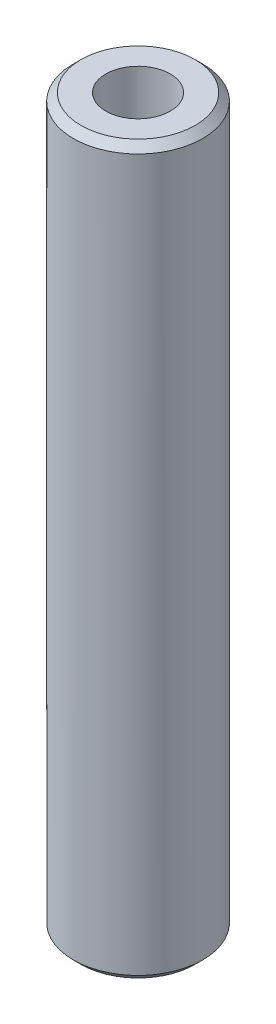
ISO-10303-21;
HEADER;
FILE_DESCRIPTION(('STEP AP214'),'2;1');
FILE_NAME('part.step','',(''),(''),'','','');
FILE_SCHEMA(('AUTOMOTIVE_DESIGN { 1 0 10303 214 1 1 1 1 }'));
ENDSEC;
DATA;
#1=APPLICATION_CONTEXT('core data for automotive mechanical design processes');
#2=APPLICATION_PROTOCOL_DEFINITION('international standard','automotive_design',2000,#1);
#3=PRODUCT_CONTEXT('',#1,'mechanical');
#4=PRODUCT('Part','Part','',(#3));
#5=PRODUCT_RELATED_PRODUCT_CATEGORY('part','',(#4));
#6=PRODUCT_DEFINITION_FORMATION('','',#4);
#7=PRODUCT_DEFINITION_CONTEXT('part definition',#1,'design');
#8=PRODUCT_DEFINITION('design','',#6,#7);
#9=PRODUCT_DEFINITION_SHAPE('','',#8);
#10=(LENGTH_UNIT() NAMED_UNIT(*) SI_UNIT(.MILLI.,.METRE.));
#11=(NAMED_UNIT(*) PLANE_ANGLE_UNIT() SI_UNIT($,.RADIAN.));
#12=(NAMED_UNIT(*) SI_UNIT($,.STERADIAN.) SOLID_ANGLE_UNIT());
#13=UNCERTAINTY_MEASURE_WITH_UNIT(LENGTH_MEASURE(1.E-05),#10,'distance_accuracy_value','');
#14=(GEOMETRIC_REPRESENTATION_CONTEXT(3) GLOBAL_UNCERTAINTY_ASSIGNED_CONTEXT((#13)) GLOBAL_UNIT_ASSIGNED_CONTEXT((#10,
#11,#12)) REPRESENTATION_CONTEXT('',''));
#15=CARTESIAN_POINT('',(0.,0.,0.));
#16=DIRECTION('',(0.,0.,1.));
#17=DIRECTION('',(1.,0.,0.));
#18=AXIS2_PLACEMENT_3D('',#15,#16,#17);
#19=CARTESIAN_POINT('',(0.,365.264584804226,0.));
#20=DIRECTION('',(0.,-1.,0.));
#21=DIRECTION('',(0.,0.,-1.));
#22=AXIS2_PLACEMENT_3D('',#19,#20,#21);
#23=CYLINDRICAL_SURFACE('',#22,32.5);
#24=CARTESIAN_POINT('',(0.,361.465812098298,0.));
#25=DIRECTION('',(0.,1.,0.));
#26=DIRECTION('',(0.,0.,1.));
#27=AXIS2_PLACEMENT_3D('',#24,#25,#26);
#28=CIRCLE('',#27,32.5);
#29=CARTESIAN_POINT('',(0.,361.465812098298,-32.5));
#30=VERTEX_POINT('',#29);
#31=EDGE_CURVE('E50',#30,#30,#28,.F.);
#32=CARTESIAN_POINT('',(0.,3.79877270592843,0.));
#33=DIRECTION('',(0.,1.,0.));
#34=DIRECTION('',(0.,0.,1.));
#35=AXIS2_PLACEMENT_3D('',#32,#33,#34);
#36=CIRCLE('',#35,32.5);
#37=CARTESIAN_POINT('',(0.,3.79877270592843,-32.5));
#38=VERTEX_POINT('',#37);
#39=EDGE_CURVE('E51',#38,#38,#36,.T.);
#40=CARTESIAN_POINT('',(0.,361.465812098298,-32.5));
#41=CARTESIAN_POINT('',(0.,357.740113771294,-32.5));
#42=CARTESIAN_POINT('',(0.,354.014415444291,-32.5));
#43=CARTESIAN_POINT('',(0.,346.563018790283,-32.5));
#44=CARTESIAN_POINT('',(0.,342.837320463279,-32.5));
#45=CARTESIAN_POINT('',(0.,335.385923809271,-32.5));
#46=CARTESIAN_POINT('',(0.,331.660225482267,-32.5));
#47=CARTESIAN_POINT('',(0.,324.20882882826,-32.5));
#48=CARTESIAN_POINT('',(0.,320.483130501256,-32.5));
#49=CARTESIAN_POINT('',(0.,313.031733847248,-32.5));
#50=CARTESIAN_POINT('',(0.,309.306035520244,-32.5));
#51=CARTESIAN_POINT('',(0.,301.854638866237,-32.5));
#52=CARTESIAN_POINT('',(0.,298.128940539233,-32.5));
#53=CARTESIAN_POINT('',(0.,290.677543885225,-32.5));
#54=CARTESIAN_POINT('',(0.,286.951845558221,-32.5));
#55=CARTESIAN_POINT('',(0.,279.500448904213,-32.5));
#56=CARTESIAN_POINT('',(0.,275.77475057721,-32.5));
#57=CARTESIAN_POINT('',(0.,268.323353923202,-32.5));
#58=CARTESIAN_POINT('',(0.,264.597655596198,-32.5));
#59=CARTESIAN_POINT('',(0.,257.14625894219,-32.5));
#60=CARTESIAN_POINT('',(0.,253.420560615187,-32.5));
#61=CARTESIAN_POINT('',(0.,245.969163961179,-32.5));
#62=CARTESIAN_POINT('',(0.,242.243465634175,-32.5));
#63=CARTESIAN_POINT('',(0.,234.792068980167,-32.5));
#64=CARTESIAN_POINT('',(0.,231.066370653163,-32.5));
#65=CARTESIAN_POINT('',(0.,223.614973999156,-32.5));
#66=CARTESIAN_POINT('',(0.,219.889275672152,-32.5));
#67=CARTESIAN_POINT('',(0.,212.437879018144,-32.5));
#68=CARTESIAN_POINT('',(0.,208.71218069114,-32.5));
#69=CARTESIAN_POINT('',(0.,201.260784037133,-32.5));
#70=CARTESIAN_POINT('',(0.,197.535085710129,-32.5));
#71=CARTESIAN_POINT('',(0.,190.083689056121,-32.5));
#72=CARTESIAN_POINT('',(0.,186.357990729117,-32.5));
#73=CARTESIAN_POINT('',(0.,178.906594075109,-32.5));
#74=CARTESIAN_POINT('',(0.,175.180895748106,-32.5));
#75=CARTESIAN_POINT('',(0.,167.729499094098,-32.5));
#76=CARTESIAN_POINT('',(0.,164.003800767094,-32.5));
#77=CARTESIAN_POINT('',(0.,156.552404113086,-32.5));
#78=CARTESIAN_POINT('',(0.,152.826705786082,-32.5));
#79=CARTESIAN_POINT('',(0.,145.375309132075,-32.5));
#80=CARTESIAN_POINT('',(0.,141.649610805071,-32.5));
#81=CARTESIAN_POINT('',(0.,134.198214151063,-32.5));
#82=CARTESIAN_POINT('',(0.,130.472515824059,-32.5));
#83=CARTESIAN_POINT('',(0.,123.021119170052,-32.5));
#84=CARTESIAN_POINT('',(0.,119.295420843048,-32.5));
#85=CARTESIAN_POINT('',(0.,111.84402418904,-32.5));
#86=CARTESIAN_POINT('',(0.,108.118325862036,-32.5));
#87=CARTESIAN_POINT('',(0.,100.666929208029,-32.5));
#88=CARTESIAN_POINT('',(0.,96.9412308810248,-32.5));
#89=CARTESIAN_POINT('',(0.,89.4898342270171,-32.5));
#90=CARTESIAN_POINT('',(0.,85.7641359000132,-32.5));
#91=CARTESIAN_POINT('',(0.,78.3127392460055,-32.5));
#92=CARTESIAN_POINT('',(0.,74.5870409190016,-32.5));
#93=CARTESIAN_POINT('',(0.,67.1356442649939,-32.5));
#94=CARTESIAN_POINT('',(0.,63.4099459379901,-32.5));
#95=CARTESIAN_POINT('',(0.,55.9585492839824,-32.5));
#96=CARTESIAN_POINT('',(0.,52.2328509569785,-32.5));
#97=CARTESIAN_POINT('',(0.,44.7814543029708,-32.5));
#98=CARTESIAN_POINT('',(0.,41.055755975967,-32.5));
#99=CARTESIAN_POINT('',(0.,33.6043593219593,-32.5));
#100=CARTESIAN_POINT('',(0.,29.8786609949554,-32.5));
#101=CARTESIAN_POINT('',(0.,22.4272643409477,-32.5));
#102=CARTESIAN_POINT('',(0.,18.7015660139438,-32.5));
#103=CARTESIAN_POINT('',(0.,11.2501693599361,-32.5));
#104=CARTESIAN_POINT('',(0.,7.52447103293226,-32.5));
#105=CARTESIAN_POINT('',(0.,3.79877270592843,-32.5));
#106=B_SPLINE_CURVE_WITH_KNOTS('',3,(#40,#41,#42,#43,#44,#45,#46,#47,#48,#49,#50,#51,#52,#53,
#54,#55,#56,#57,#58,#59,#60,#61,#62,#63,#64,#65,#66,#67,#68,#69,#70,#71,#72,#73,#74,#75,#76,#77,
#78,#79,#80,#81,#82,#83,#84,#85,#86,#87,#88,#89,#90,#91,#92,#93,#94,#95,#96,#97,#98,#99,#100,
#101,#102,#103,#104,#105),.UNSPECIFIED.,.F.,.F.,(4,2,2,2,2,2,2,2,2,2,2,2,2,2,2,2,2,2,2,2,2,2,2,
2,2,2,2,2,2,2,2,2,4),(0.,11.1770949810116,22.3541899620232,33.5312849430347,44.7083799240462,
55.8854749050578,67.0625698860693,78.2396648670809,89.4167598480925,100.593854829104,
111.770949810116,122.948044791127,134.125139772139,145.30223475315,156.479329734162,
167.656424715173,178.833519696185,190.010614677196,201.187709658208,212.36480463922,
223.541899620231,234.718994601243,245.896089582254,257.073184563266,268.250279544277,
279.427374525289,290.604469506301,301.781564487312,312.958659468324,324.135754449335,
335.312849430347,346.489944411358,357.66703939237),.UNSPECIFIED.);
#107=EDGE_CURVE('BSEAM39',#30,#38,#106,.T.);
#108=ORIENTED_EDGE('',*,*,#31,.T.);
#109=ORIENTED_EDGE('',*,*,#39,.T.);
#110=ORIENTED_EDGE('',*,*,#107,.T.);
#111=ORIENTED_EDGE('',*,*,#107,.F.);
#112=EDGE_LOOP('',(#108,#110,#109,#111));
#113=FACE_BOUND('',#112,.T.);
#114=ADVANCED_FACE('F39',(#113),#23,.T.);
#115=CARTESIAN_POINT('',(0.,365.264584804226,0.));
#116=DIRECTION('',(0.,1.,0.));
#117=DIRECTION('',(0.,0.,1.));
#118=AXIS2_PLACEMENT_3D('',#115,#116,#117);
#119=PLANE('',#118);
#120=CARTESIAN_POINT('',(0.,365.264584804226,0.));
#121=DIRECTION('',(0.,1.,0.));
#122=DIRECTION('',(0.,0.,1.));
#123=AXIS2_PLACEMENT_3D('',#120,#121,#122);
#124=CIRCLE('',#123,28.701227294072);
#125=CARTESIAN_POINT('',(0.,365.264584804226,28.701227294072));
#126=VERTEX_POINT('',#125);
#127=EDGE_CURVE('E54',#126,#126,#124,.T.);
#128=ORIENTED_EDGE('',*,*,#127,.T.);
#129=EDGE_LOOP('',(#128));
#130=FACE_BOUND('',#129,.T.);
#131=CARTESIAN_POINT('',(0.,365.264584804226,0.));
#132=DIRECTION('',(0.,1.,0.));
#133=DIRECTION('',(0.,0.,1.));
#134=AXIS2_PLACEMENT_3D('',#131,#132,#133);
#135=CIRCLE('',#134,16.206036202935);
#136=CARTESIAN_POINT('',(0.,365.264584804226,-16.206036202935));
#137=VERTEX_POINT('',#136);
#138=EDGE_CURVE('E58',#137,#137,#135,.T.);
#139=ORIENTED_EDGE('',*,*,#138,.F.);
#140=EDGE_LOOP('',(#139));
#141=FACE_BOUND('',#140,.T.);
#142=ADVANCED_FACE('F69',(#130,#141),#119,.T.);
#143=CARTESIAN_POINT('',(0.,0.,0.));
#144=DIRECTION('',(0.,1.,0.));
#145=DIRECTION('',(0.,0.,1.));
#146=AXIS2_PLACEMENT_3D('',#143,#144,#145);
#147=PLANE('',#146);
#148=CARTESIAN_POINT('',(0.,0.,0.));
#149=DIRECTION('',(0.,1.,0.));
#150=DIRECTION('',(0.,0.,1.));
#151=AXIS2_PLACEMENT_3D('',#148,#149,#150);
#152=CIRCLE('',#151,28.7012272940715);
#153=CARTESIAN_POINT('',(0.,0.,28.7012272940715));
#154=VERTEX_POINT('',#153);
#155=EDGE_CURVE('E10',#154,#154,#152,.F.);
#156=ORIENTED_EDGE('',*,*,#155,.T.);
#157=EDGE_LOOP('',(#156));
#158=FACE_BOUND('',#157,.T.);
#159=CARTESIAN_POINT('',(0.,0.,0.));
#160=DIRECTION('',(0.,1.,0.));
#161=DIRECTION('',(0.,0.,1.));
#162=AXIS2_PLACEMENT_3D('',#159,#160,#161);
#163=CIRCLE('',#162,16.206036202935);
#164=CARTESIAN_POINT('',(0.,0.,-16.206036202935));
#165=VERTEX_POINT('',#164);
#166=EDGE_CURVE('E63',#165,#165,#163,.T.);
#167=ORIENTED_EDGE('',*,*,#166,.T.);
#168=EDGE_LOOP('',(#167));
#169=FACE_BOUND('',#168,.T.);
#170=ADVANCED_FACE('F75',(#158,#169),#147,.F.);
#171=CARTESIAN_POINT('',(0.,365.264584804226,0.));
#172=DIRECTION('',(0.,-1.,0.));
#173=DIRECTION('',(0.,0.,-1.));
#174=AXIS2_PLACEMENT_3D('',#171,#172,#173);
#175=CYLINDRICAL_SURFACE('',#174,16.206036202935);
#176=CARTESIAN_POINT('',(0.,365.264584804226,-16.206036202935));
#177=CARTESIAN_POINT('',(0.,361.459745379182,-16.206036202935));
#178=CARTESIAN_POINT('',(0.,357.654905954138,-16.206036202935));
#179=CARTESIAN_POINT('',(0.,350.04522710405,-16.206036202935));
#180=CARTESIAN_POINT('',(0.,346.240387679006,-16.206036202935));
#181=CARTESIAN_POINT('',(0.,338.630708828918,-16.206036202935));
#182=CARTESIAN_POINT('',(0.,334.825869403874,-16.206036202935));
#183=CARTESIAN_POINT('',(0.,327.216190553786,-16.206036202935));
#184=CARTESIAN_POINT('',(0.,323.411351128742,-16.206036202935));
#185=CARTESIAN_POINT('',(0.,315.801672278654,-16.206036202935));
#186=CARTESIAN_POINT('',(0.,311.99683285361,-16.206036202935));
#187=CARTESIAN_POINT('',(0.,304.387154003522,-16.206036202935));
#188=CARTESIAN_POINT('',(0.,300.582314578478,-16.206036202935));
#189=CARTESIAN_POINT('',(0.,292.97263572839,-16.206036202935));
#190=CARTESIAN_POINT('',(0.,289.167796303346,-16.206036202935));
#191=CARTESIAN_POINT('',(0.,281.558117453258,-16.206036202935));
#192=CARTESIAN_POINT('',(0.,277.753278028214,-16.206036202935));
#193=CARTESIAN_POINT('',(0.,270.143599178126,-16.206036202935));
#194=CARTESIAN_POINT('',(0.,266.338759753082,-16.206036202935));
#195=CARTESIAN_POINT('',(0.,258.729080902994,-16.206036202935));
#196=CARTESIAN_POINT('',(0.,254.92424147795,-16.206036202935));
#197=CARTESIAN_POINT('',(0.,247.314562627862,-16.206036202935));
#198=CARTESIAN_POINT('',(0.,243.509723202817,-16.206036202935));
#199=CARTESIAN_POINT('',(0.,235.900044352729,-16.206036202935));
#200=CARTESIAN_POINT('',(0.,232.095204927685,-16.206036202935));
#201=CARTESIAN_POINT('',(0.,224.485526077597,-16.206036202935));
#202=CARTESIAN_POINT('',(0.,220.680686652553,-16.206036202935));
#203=CARTESIAN_POINT('',(0.,213.071007802465,-16.206036202935));
#204=CARTESIAN_POINT('',(0.,209.266168377421,-16.206036202935));
#205=CARTESIAN_POINT('',(0.,201.656489527333,-16.206036202935));
#206=CARTESIAN_POINT('',(0.,197.851650102289,-16.206036202935));
#207=CARTESIAN_POINT('',(0.,190.241971252201,-16.206036202935));
#208=CARTESIAN_POINT('',(0.,186.437131827157,-16.206036202935));
#209=CARTESIAN_POINT('',(0.,178.827452977069,-16.206036202935));
#210=CARTESIAN_POINT('',(0.,175.022613552025,-16.206036202935));
#211=CARTESIAN_POINT('',(0.,167.412934701937,-16.206036202935));
#212=CARTESIAN_POINT('',(0.,163.608095276893,-16.206036202935));
#213=CARTESIAN_POINT('',(0.,155.998416426805,-16.206036202935));
#214=CARTESIAN_POINT('',(0.,152.193577001761,-16.206036202935));
#215=CARTESIAN_POINT('',(0.,144.583898151673,-16.206036202935));
#216=CARTESIAN_POINT('',(0.,140.779058726629,-16.206036202935));
#217=CARTESIAN_POINT('',(0.,133.169379876541,-16.206036202935));
#218=CARTESIAN_POINT('',(0.,129.364540451497,-16.206036202935));
#219=CARTESIAN_POINT('',(0.,121.754861601409,-16.206036202935));
#220=CARTESIAN_POINT('',(0.,117.950022176365,-16.206036202935));
#221=CARTESIAN_POINT('',(0.,110.340343326277,-16.206036202935));
#222=CARTESIAN_POINT('',(0.,106.535503901233,-16.206036202935));
#223=CARTESIAN_POINT('',(0.,98.9258250511446,-16.206036202935));
#224=CARTESIAN_POINT('',(0.,95.1209856261006,-16.206036202935));
#225=CARTESIAN_POINT('',(0.,87.5113067760125,-16.206036202935));
#226=CARTESIAN_POINT('',(0.,83.7064673509685,-16.206036202935));
#227=CARTESIAN_POINT('',(0.,76.0967885008805,-16.206036202935));
#228=CARTESIAN_POINT('',(0.,72.2919490758364,-16.206036202935));
#229=CARTESIAN_POINT('',(0.,64.6822702257484,-16.206036202935));
#230=CARTESIAN_POINT('',(0.,60.8774308007044,-16.206036202935));
#231=CARTESIAN_POINT('',(0.,53.2677519506163,-16.206036202935));
#232=CARTESIAN_POINT('',(0.,49.4629125255723,-16.206036202935));
#233=CARTESIAN_POINT('',(0.,41.8532336754842,-16.206036202935));
#234=CARTESIAN_POINT('',(0.,38.0483942504402,-16.206036202935));
#235=CARTESIAN_POINT('',(0.,30.4387154003522,-16.206036202935));
#236=CARTESIAN_POINT('',(0.,26.6338759753082,-16.206036202935));
#237=CARTESIAN_POINT('',(0.,19.0241971252201,-16.206036202935));
#238=CARTESIAN_POINT('',(0.,15.2193577001761,-16.206036202935));
#239=CARTESIAN_POINT('',(0.,7.60967885008805,-16.206036202935));
#240=CARTESIAN_POINT('',(0.,3.80483942504402,-16.206036202935));
#241=CARTESIAN_POINT('',(0.,0.,-16.206036202935));
#242=B_SPLINE_CURVE_WITH_KNOTS('',3,(#176,#177,#178,#179,#180,#181,#182,#183,#184,#185,#186,
#187,#188,#189,#190,#191,#192,#193,#194,#195,#196,#197,#198,#199,#200,#201,#202,#203,#204,#205,
#206,#207,#208,#209,#210,#211,#212,#213,#214,#215,#216,#217,#218,#219,#220,#221,#222,#223,#224,
#225,#226,#227,#228,#229,#230,#231,#232,#233,#234,#235,#236,#237,#238,#239,#240,#241),
.UNSPECIFIED.,.F.,.F.,(4,2,2,2,2,2,2,2,2,2,2,2,2,2,2,2,2,2,2,2,2,2,2,2,2,2,2,2,2,2,2,2,4),(0.,
11.4145182751321,22.8290365502642,34.2435548253963,45.6580731005283,57.0725913756604,
68.4871096507925,79.9016279259245,91.3161462010566,102.730664476189,114.145182751321,
125.559701026453,136.974219301585,148.388737576717,159.803255851849,171.217774126981,
182.632292402113,194.046810677245,205.461328952377,216.875847227509,228.290365502641,
239.704883777774,251.119402052906,262.533920328038,273.94843860317,285.362956878302,
296.777475153434,308.191993428566,319.606511703698,331.02102997883,342.435548253962,
353.850066529094,365.264584804226),.UNSPECIFIED.);
#243=EDGE_CURVE('BSEAM70',#137,#165,#242,.T.);
#244=ORIENTED_EDGE('',*,*,#138,.T.);
#245=ORIENTED_EDGE('',*,*,#166,.F.);
#246=ORIENTED_EDGE('',*,*,#243,.T.);
#247=ORIENTED_EDGE('',*,*,#243,.F.);
#248=EDGE_LOOP('',(#244,#246,#245,#247));
#249=FACE_BOUND('',#248,.T.);
#250=ADVANCED_FACE('F70',(#249),#175,.F.);
#251=CARTESIAN_POINT('',(0.,365.264584804226,0.));
#252=DIRECTION('',(0.,-1.,0.));
#253=DIRECTION('',(0.,0.,-1.));
#254=AXIS2_PLACEMENT_3D('',#251,#252,#253);
#255=CONICAL_SURFACE('',#254,28.701227294072,0.785398163397446);
#256=ORIENTED_EDGE('',*,*,#31,.F.);
#257=EDGE_LOOP('',(#256));
#258=FACE_BOUND('',#257,.T.);
#259=ORIENTED_EDGE('',*,*,#127,.F.);
#260=EDGE_LOOP('',(#259));
#261=FACE_BOUND('',#260,.T.);
#262=ADVANCED_FACE('F81',(#258,#261),#255,.T.);
#263=CARTESIAN_POINT('',(0.,3.79877270592843,0.));
#264=DIRECTION('',(0.,1.,0.));
#265=DIRECTION('',(0.,0.,1.));
#266=AXIS2_PLACEMENT_3D('',#263,#264,#265);
#267=CONICAL_SURFACE('',#266,32.5,0.785398163397456);
#268=ORIENTED_EDGE('',*,*,#155,.F.);
#269=EDGE_LOOP('',(#268));
#270=FACE_BOUND('',#269,.T.);
#271=ORIENTED_EDGE('',*,*,#39,.F.);
#272=EDGE_LOOP('',(#271));
#273=FACE_BOUND('',#272,.T.);
#274=ADVANCED_FACE('F45',(#270,#273),#267,.T.);
#275=CLOSED_SHELL('',(#114,#142,#170,#250,#262,#274));
#276=MANIFOLD_SOLID_BREP('B2',#275);
#277=ADVANCED_BREP_SHAPE_REPRESENTATION('',(#18,#276),#14);
#278=SHAPE_DEFINITION_REPRESENTATION(#9,#277);
ENDSEC;
END-ISO-10303-21;
